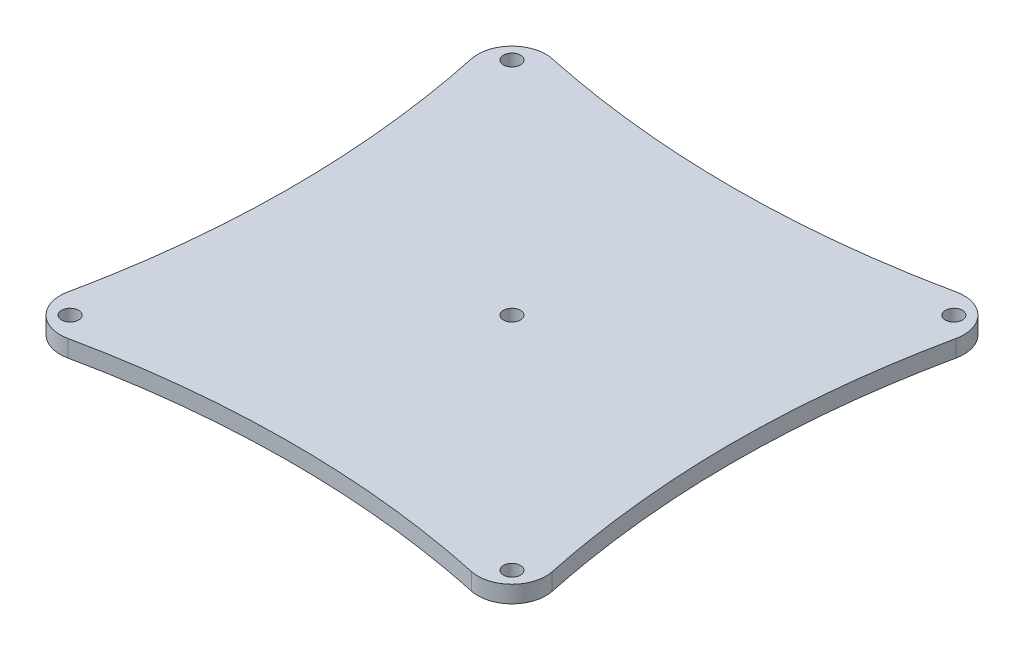
ISO-10303-21;
HEADER;
FILE_DESCRIPTION(('STEP AP214'),'2;1');
FILE_NAME('part.step','',(''),(''),'','','');
FILE_SCHEMA(('AUTOMOTIVE_DESIGN { 1 0 10303 214 1 1 1 1 }'));
ENDSEC;
DATA;
#1=APPLICATION_CONTEXT('core data for automotive mechanical design processes');
#2=APPLICATION_PROTOCOL_DEFINITION('international standard','automotive_design',2000,#1);
#3=PRODUCT_CONTEXT('',#1,'mechanical');
#4=PRODUCT('Part','Part','',(#3));
#5=PRODUCT_RELATED_PRODUCT_CATEGORY('part','',(#4));
#6=PRODUCT_DEFINITION_FORMATION('','',#4);
#7=PRODUCT_DEFINITION_CONTEXT('part definition',#1,'design');
#8=PRODUCT_DEFINITION('design','',#6,#7);
#9=PRODUCT_DEFINITION_SHAPE('','',#8);
#10=(LENGTH_UNIT() NAMED_UNIT(*) SI_UNIT(.MILLI.,.METRE.));
#11=(NAMED_UNIT(*) PLANE_ANGLE_UNIT() SI_UNIT($,.RADIAN.));
#12=(NAMED_UNIT(*) SI_UNIT($,.STERADIAN.) SOLID_ANGLE_UNIT());
#13=UNCERTAINTY_MEASURE_WITH_UNIT(LENGTH_MEASURE(1.E-05),#10,'distance_accuracy_value','');
#14=(GEOMETRIC_REPRESENTATION_CONTEXT(3) GLOBAL_UNCERTAINTY_ASSIGNED_CONTEXT((#13)) GLOBAL_UNIT_ASSIGNED_CONTEXT((#10,
#11,#12)) REPRESENTATION_CONTEXT('',''));
#15=CARTESIAN_POINT('',(0.,0.,0.));
#16=DIRECTION('',(0.,0.,1.));
#17=DIRECTION('',(1.,0.,0.));
#18=AXIS2_PLACEMENT_3D('',#15,#16,#17);
#19=CARTESIAN_POINT('',(173.322472128066,3.175,-173.342498930192));
#20=DIRECTION('',(0.,-1.,0.));
#21=DIRECTION('',(0.,0.,-1.));
#22=AXIS2_PLACEMENT_3D('',#19,#20,#21);
#23=CYLINDRICAL_SURFACE('',#22,12.7);
#24=CARTESIAN_POINT('',(173.322472128065,0.,-173.34249893019));
#25=DIRECTION('',(0.,1.,0.));
#26=DIRECTION('',(0.,0.,1.));
#27=AXIS2_PLACEMENT_3D('',#24,#25,#26);
#28=CIRCLE('',#27,12.7);
#29=CARTESIAN_POINT('',(170.697797431039,0.,-185.768322151804));
#30=VERTEX_POINT('',#29);
#31=CARTESIAN_POINT('',(185.746749635017,0.,-170.710517085599));
#32=VERTEX_POINT('',#31);
#33=EDGE_CURVE('E175',#30,#32,#28,.F.);
#34=ORIENTED_EDGE('',*,*,#33,.F.);
#35=DIRECTION('',(0.,-1.,0.));
#36=VECTOR('',#35,1.);
#37=CARTESIAN_POINT('',(170.697797431039,6.35,-185.768322151804));
#38=LINE('',#37,#36);
#39=CARTESIAN_POINT('',(170.697797431039,6.35,-185.768322151804));
#40=VERTEX_POINT('',#39);
#41=EDGE_CURVE('E115',#40,#30,#38,.T.);
#42=ORIENTED_EDGE('',*,*,#41,.F.);
#43=CARTESIAN_POINT('',(173.322472128065,6.35,-173.34249893019));
#44=DIRECTION('',(0.,1.,0.));
#45=DIRECTION('',(0.,0.,1.));
#46=AXIS2_PLACEMENT_3D('',#43,#44,#45);
#47=CIRCLE('',#46,12.7);
#48=CARTESIAN_POINT('',(185.746749635017,6.35,-170.710517085599));
#49=VERTEX_POINT('',#48);
#50=EDGE_CURVE('E122',#40,#49,#47,.F.);
#51=ORIENTED_EDGE('',*,*,#50,.T.);
#52=DIRECTION('',(0.,-1.,0.));
#53=VECTOR('',#52,1.);
#54=CARTESIAN_POINT('',(185.746749635017,6.35,-170.710517085599));
#55=LINE('',#54,#53);
#56=EDGE_CURVE('E172',#49,#32,#55,.T.);
#57=ORIENTED_EDGE('',*,*,#56,.T.);
#58=EDGE_LOOP('',(#34,#42,#51,#57));
#59=FACE_BOUND('',#58,.T.);
#60=ADVANCED_FACE('F35',(#59),#23,.T.);
#61=CARTESIAN_POINT('',(173.349019247905,3.175,-17.1466710257305));
#62=DIRECTION('',(0.,-1.,0.));
#63=DIRECTION('',(0.,0.,-1.));
#64=AXIS2_PLACEMENT_3D('',#61,#62,#63);
#65=CYLINDRICAL_SURFACE('',#64,12.7);
#66=CARTESIAN_POINT('',(173.349019247892,0.,-17.1466710257332));
#67=DIRECTION('',(0.,1.,0.));
#68=DIRECTION('',(0.,0.,1.));
#69=AXIS2_PLACEMENT_3D('',#66,#67,#68);
#70=CIRCLE('',#69,12.7);
#71=CARTESIAN_POINT('',(185.773513411456,0.,-19.7776299344923));
#72=VERTEX_POINT('',#71);
#73=CARTESIAN_POINT('',(170.697797431039,0.,-4.72648492093428));
#74=VERTEX_POINT('',#73);
#75=EDGE_CURVE('E187',#72,#74,#70,.F.);
#76=ORIENTED_EDGE('',*,*,#75,.F.);
#77=DIRECTION('',(0.,-1.,0.));
#78=VECTOR('',#77,1.);
#79=CARTESIAN_POINT('',(185.773513411456,6.35,-19.7776299344923));
#80=LINE('',#79,#78);
#81=CARTESIAN_POINT('',(185.773513411456,6.35,-19.7776299344923));
#82=VERTEX_POINT('',#81);
#83=EDGE_CURVE('E177',#82,#72,#80,.T.);
#84=ORIENTED_EDGE('',*,*,#83,.F.);
#85=CARTESIAN_POINT('',(173.349019247892,6.35,-17.1466710257332));
#86=DIRECTION('',(0.,1.,0.));
#87=DIRECTION('',(0.,0.,1.));
#88=AXIS2_PLACEMENT_3D('',#85,#86,#87);
#89=CIRCLE('',#88,12.7);
#90=CARTESIAN_POINT('',(170.697797431039,6.35,-4.72648492093428));
#91=VERTEX_POINT('',#90);
#92=EDGE_CURVE('E166',#82,#91,#89,.F.);
#93=ORIENTED_EDGE('',*,*,#92,.T.);
#94=DIRECTION('',(0.,-1.,0.));
#95=VECTOR('',#94,1.);
#96=CARTESIAN_POINT('',(170.697797431039,6.35,-4.72648492093428));
#97=LINE('',#96,#95);
#98=EDGE_CURVE('E43',#91,#74,#97,.T.);
#99=ORIENTED_EDGE('',*,*,#98,.T.);
#100=EDGE_LOOP('',(#76,#84,#93,#99));
#101=FACE_BOUND('',#100,.T.);
#102=ADVANCED_FACE('F185',(#101),#65,.T.);
#103=CARTESIAN_POINT('',(17.1829414635356,3.175,-17.1829163185345));
#104=DIRECTION('',(0.,-1.,0.));
#105=DIRECTION('',(0.,0.,-1.));
#106=AXIS2_PLACEMENT_3D('',#103,#104,#105);
#107=CYLINDRICAL_SURFACE('',#106,12.7);
#108=CARTESIAN_POINT('',(17.182941463536,0.,-17.1829163185367));
#109=DIRECTION('',(0.,1.,0.));
#110=DIRECTION('',(0.,0.,1.));
#111=AXIS2_PLACEMENT_3D('',#108,#109,#110);
#112=CIRCLE('',#111,12.7);
#113=CARTESIAN_POINT('',(4.75848888429607,0.,-19.8140715982983));
#114=VERTEX_POINT('',#113);
#115=CARTESIAN_POINT('',(19.8140882518395,0.,-4.75846194104384));
#116=VERTEX_POINT('',#115);
#117=EDGE_CURVE('E195',#114,#116,#112,.T.);
#118=ORIENTED_EDGE('',*,*,#117,.T.);
#119=DIRECTION('',(0.,-1.,0.));
#120=VECTOR('',#119,1.);
#121=CARTESIAN_POINT('',(19.8140882518395,6.35,-4.75846194104384));
#122=LINE('',#121,#120);
#123=CARTESIAN_POINT('',(19.8140882518395,6.35,-4.75846194104384));
#124=VERTEX_POINT('',#123);
#125=EDGE_CURVE('E11',#124,#116,#122,.T.);
#126=ORIENTED_EDGE('',*,*,#125,.F.);
#127=CARTESIAN_POINT('',(17.182941463536,6.35,-17.1829163185367));
#128=DIRECTION('',(0.,1.,0.));
#129=DIRECTION('',(0.,0.,1.));
#130=AXIS2_PLACEMENT_3D('',#127,#128,#129);
#131=CIRCLE('',#130,12.7);
#132=CARTESIAN_POINT('',(4.75848888429607,6.35,-19.8140715982983));
#133=VERTEX_POINT('',#132);
#134=EDGE_CURVE('E228',#133,#124,#131,.T.);
#135=ORIENTED_EDGE('',*,*,#134,.F.);
#136=DIRECTION('',(0.,-1.,0.));
#137=VECTOR('',#136,1.);
#138=CARTESIAN_POINT('',(4.75848888429607,6.35,-19.8140715982983));
#139=LINE('',#138,#137);
#140=EDGE_CURVE('E126',#133,#114,#139,.T.);
#141=ORIENTED_EDGE('',*,*,#140,.T.);
#142=EDGE_LOOP('',(#118,#126,#135,#141));
#143=FACE_BOUND('',#142,.T.);
#144=ADVANCED_FACE('F227',(#143),#107,.T.);
#145=CARTESIAN_POINT('',(17.1575077953163,3.175,-173.322440287928));
#146=DIRECTION('',(0.,-1.,0.));
#147=DIRECTION('',(0.,0.,-1.));
#148=AXIS2_PLACEMENT_3D('',#145,#146,#147);
#149=CYLINDRICAL_SURFACE('',#148,12.7);
#150=CARTESIAN_POINT('',(17.1575077953184,0.,-173.322440287928));
#151=DIRECTION('',(0.,1.,0.));
#152=DIRECTION('',(0.,0.,1.));
#153=AXIS2_PLACEMENT_3D('',#150,#151,#152);
#154=CIRCLE('',#153,12.7);
#155=CARTESIAN_POINT('',(4.73168435694636,0.,-170.697766617087));
#156=VERTEX_POINT('',#155);
#157=CARTESIAN_POINT('',(19.78949709556,0.,-185.746716215458));
#158=VERTEX_POINT('',#157);
#159=EDGE_CURVE('E213',#156,#158,#154,.F.);
#160=ORIENTED_EDGE('',*,*,#159,.F.);
#161=DIRECTION('',(0.,-1.,0.));
#162=VECTOR('',#161,1.);
#163=CARTESIAN_POINT('',(4.73168435694636,6.35,-170.697766617087));
#164=LINE('',#163,#162);
#165=CARTESIAN_POINT('',(4.73168435694636,6.35,-170.697766617087));
#166=VERTEX_POINT('',#165);
#167=EDGE_CURVE('E79',#166,#156,#164,.T.);
#168=ORIENTED_EDGE('',*,*,#167,.F.);
#169=CARTESIAN_POINT('',(17.1575077953184,6.35,-173.322440287928));
#170=DIRECTION('',(0.,1.,0.));
#171=DIRECTION('',(0.,0.,1.));
#172=AXIS2_PLACEMENT_3D('',#169,#170,#171);
#173=CIRCLE('',#172,12.7);
#174=CARTESIAN_POINT('',(19.78949709556,6.35,-185.746716215458));
#175=VERTEX_POINT('',#174);
#176=EDGE_CURVE('E119',#166,#175,#173,.F.);
#177=ORIENTED_EDGE('',*,*,#176,.T.);
#178=DIRECTION('',(0.,-1.,0.));
#179=VECTOR('',#178,1.);
#180=CARTESIAN_POINT('',(19.78949709556,6.35,-185.746716215458));
#181=LINE('',#180,#179);
#182=EDGE_CURVE('E105',#175,#158,#181,.T.);
#183=ORIENTED_EDGE('',*,*,#182,.T.);
#184=EDGE_LOOP('',(#160,#168,#177,#183));
#185=FACE_BOUND('',#184,.T.);
#186=ADVANCED_FACE('F124',(#185),#149,.T.);
#187=CARTESIAN_POINT('',(19.8140882518395,6.35,-4.75846194104384));
#188=CARTESIAN_POINT('',(44.8371963997863,6.35,-10.057646004705));
#189=CARTESIAN_POINT('',(95.3044221773575,6.35,-15.3264775848769));
#190=CARTESIAN_POINT('',(145.574109724461,6.35,-10.0894052834637));
#191=CARTESIAN_POINT('',(170.697797431039,6.35,-4.72648492093429));
#192=B_SPLINE_CURVE_WITH_KNOTS('',3,(#187,#188,#189,#190,#191),.UNSPECIFIED.,.F.,.F.,(4,1,4),
(0.104614208546919,0.50035773003242,0.896180420296307),.UNSPECIFIED.);
#193=DIRECTION('',(0.,-1.,0.));
#194=VECTOR('',#193,1.);
#195=SURFACE_OF_LINEAR_EXTRUSION('',#192,#194);
#196=CARTESIAN_POINT('',(19.8140882518395,0.,-4.75846194104384));
#197=CARTESIAN_POINT('',(44.8371963997863,0.,-10.057646004705));
#198=CARTESIAN_POINT('',(95.3044221773575,0.,-15.3264775848769));
#199=CARTESIAN_POINT('',(145.574109724461,0.,-10.0894052834637));
#200=CARTESIAN_POINT('',(170.697797431039,0.,-4.72648492093429));
#201=B_SPLINE_CURVE_WITH_KNOTS('',3,(#196,#197,#198,#199,#200),.UNSPECIFIED.,.F.,.F.,(4,1,4),
(0.104614208546919,0.50035773003242,0.896180420296307),.UNSPECIFIED.);
#202=EDGE_CURVE('E190',#116,#74,#201,.T.);
#203=ORIENTED_EDGE('',*,*,#202,.T.);
#204=ORIENTED_EDGE('',*,*,#98,.F.);
#205=EDGE_CURVE('E90',#124,#91,#192,.T.);
#206=ORIENTED_EDGE('',*,*,#205,.F.);
#207=ORIENTED_EDGE('',*,*,#125,.T.);
#208=EDGE_LOOP('',(#203,#204,#206,#207));
#209=FACE_BOUND('',#208,.T.);
#210=ADVANCED_FACE('F156',(#209),#195,.F.);
#211=CARTESIAN_POINT('',(185.746749635017,6.35,-170.710517085599));
#212=CARTESIAN_POINT('',(180.44493801681,6.35,-145.683300819084));
#213=CARTESIAN_POINT('',(175.152166761295,6.35,-95.1916322511341));
#214=CARTESIAN_POINT('',(180.450729476529,6.35,-44.9140536592783));
#215=CARTESIAN_POINT('',(185.773513411456,6.35,-19.7776299344923));
#216=B_SPLINE_CURVE_WITH_KNOTS('',3,(#211,#212,#213,#214,#215),.UNSPECIFIED.,.F.,.F.,(4,1,4),
(0.104484496174819,0.500294391382567,0.896180420296308),.UNSPECIFIED.);
#217=DIRECTION('',(0.,-1.,0.));
#218=VECTOR('',#217,1.);
#219=SURFACE_OF_LINEAR_EXTRUSION('',#216,#218);
#220=CARTESIAN_POINT('',(185.746749635017,0.,-170.710517085599));
#221=CARTESIAN_POINT('',(180.44493801681,0.,-145.683300819084));
#222=CARTESIAN_POINT('',(175.152166761295,0.,-95.1916322511341));
#223=CARTESIAN_POINT('',(180.450729476529,0.,-44.9140536592783));
#224=CARTESIAN_POINT('',(185.773513411456,0.,-19.7776299344923));
#225=B_SPLINE_CURVE_WITH_KNOTS('',3,(#220,#221,#222,#223,#224),.UNSPECIFIED.,.F.,.F.,(4,1,4),
(0.104484496174819,0.500294391382567,0.896180420296308),.UNSPECIFIED.);
#226=EDGE_CURVE('E197',#32,#72,#225,.T.);
#227=ORIENTED_EDGE('',*,*,#226,.F.);
#228=ORIENTED_EDGE('',*,*,#56,.F.);
#229=EDGE_CURVE('E160',#49,#82,#216,.T.);
#230=ORIENTED_EDGE('',*,*,#229,.T.);
#231=ORIENTED_EDGE('',*,*,#83,.T.);
#232=EDGE_LOOP('',(#227,#228,#230,#231));
#233=FACE_BOUND('',#232,.T.);
#234=ADVANCED_FACE('F152',(#233),#219,.T.);
#235=CARTESIAN_POINT('',(19.78949709556,6.35,-185.746716215458));
#236=CARTESIAN_POINT('',(44.8165997125433,6.35,-180.444912980548));
#237=CARTESIAN_POINT('',(95.3011699201255,6.35,-175.147507505945));
#238=CARTESIAN_POINT('',(145.567291034131,6.35,-180.460069886551));
#239=CARTESIAN_POINT('',(170.697797431039,6.35,-185.768322151804));
#240=B_SPLINE_CURVE_WITH_KNOTS('',3,(#235,#236,#237,#238,#239),.UNSPECIFIED.,.F.,.F.,(4,1,4),
(0.104485326636814,0.500295423838561,0.896051430089074),.UNSPECIFIED.);
#241=DIRECTION('',(0.,-1.,0.));
#242=VECTOR('',#241,1.);
#243=SURFACE_OF_LINEAR_EXTRUSION('',#240,#242);
#244=CARTESIAN_POINT('',(19.78949709556,0.,-185.746716215458));
#245=CARTESIAN_POINT('',(44.8165997125433,0.,-180.444912980548));
#246=CARTESIAN_POINT('',(95.3011699201255,0.,-175.147507505945));
#247=CARTESIAN_POINT('',(145.567291034131,0.,-180.460069886551));
#248=CARTESIAN_POINT('',(170.697797431039,0.,-185.768322151804));
#249=B_SPLINE_CURVE_WITH_KNOTS('',3,(#244,#245,#246,#247,#248),.UNSPECIFIED.,.F.,.F.,(4,1,4),
(0.104485326636814,0.500295423838561,0.896051430089074),.UNSPECIFIED.);
#250=EDGE_CURVE('E110',#158,#30,#249,.T.);
#251=ORIENTED_EDGE('',*,*,#250,.F.);
#252=ORIENTED_EDGE('',*,*,#182,.F.);
#253=EDGE_CURVE('E108',#175,#40,#240,.T.);
#254=ORIENTED_EDGE('',*,*,#253,.T.);
#255=ORIENTED_EDGE('',*,*,#41,.T.);
#256=EDGE_LOOP('',(#251,#252,#254,#255));
#257=FACE_BOUND('',#256,.T.);
#258=ADVANCED_FACE('F107',(#257),#243,.T.);
#259=CARTESIAN_POINT('',(95.25,6.35,-95.25));
#260=DIRECTION('',(0.,-1.,0.));
#261=DIRECTION('',(0.,0.,-1.));
#262=AXIS2_PLACEMENT_3D('',#259,#260,#261);
#263=CYLINDRICAL_SURFACE('',#262,3.175);
#264=CARTESIAN_POINT('',(95.25,6.35,-95.25));
#265=DIRECTION('',(0.,1.,0.));
#266=DIRECTION('',(0.,0.,1.));
#267=AXIS2_PLACEMENT_3D('',#264,#265,#266);
#268=CIRCLE('',#267,3.175);
#269=CARTESIAN_POINT('',(95.25,6.35,-92.075));
#270=VERTEX_POINT('',#269);
#271=EDGE_CURVE('E368',#270,#270,#268,.T.);
#272=ORIENTED_EDGE('',*,*,#271,.T.);
#273=EDGE_LOOP('',(#272));
#274=FACE_BOUND('',#273,.T.);
#275=CARTESIAN_POINT('',(95.25,0.,-95.25));
#276=DIRECTION('',(0.,1.,0.));
#277=DIRECTION('',(0.,0.,1.));
#278=AXIS2_PLACEMENT_3D('',#275,#276,#277);
#279=CIRCLE('',#278,3.175);
#280=CARTESIAN_POINT('',(95.25,0.,-92.075));
#281=VERTEX_POINT('',#280);
#282=EDGE_CURVE('E229',#281,#281,#279,.T.);
#283=ORIENTED_EDGE('',*,*,#282,.F.);
#284=EDGE_LOOP('',(#283));
#285=FACE_BOUND('',#284,.T.);
#286=ADVANCED_FACE('F151',(#274,#285),#263,.F.);
#287=CARTESIAN_POINT('',(177.8,6.35,-177.8));
#288=DIRECTION('',(0.,-1.,0.));
#289=DIRECTION('',(0.,0.,-1.));
#290=AXIS2_PLACEMENT_3D('',#287,#288,#289);
#291=CYLINDRICAL_SURFACE('',#290,3.175);
#292=CARTESIAN_POINT('',(177.8,6.35,-177.8));
#293=DIRECTION('',(0.,1.,0.));
#294=DIRECTION('',(0.,0.,1.));
#295=AXIS2_PLACEMENT_3D('',#292,#293,#294);
#296=CIRCLE('',#295,3.175);
#297=CARTESIAN_POINT('',(177.8,6.35,-174.625));
#298=VERTEX_POINT('',#297);
#299=EDGE_CURVE('E365',#298,#298,#296,.T.);
#300=ORIENTED_EDGE('',*,*,#299,.T.);
#301=EDGE_LOOP('',(#300));
#302=FACE_BOUND('',#301,.T.);
#303=CARTESIAN_POINT('',(177.8,0.,-177.8));
#304=DIRECTION('',(0.,1.,0.));
#305=DIRECTION('',(0.,0.,1.));
#306=AXIS2_PLACEMENT_3D('',#303,#304,#305);
#307=CIRCLE('',#306,3.175);
#308=CARTESIAN_POINT('',(177.8,0.,-174.625));
#309=VERTEX_POINT('',#308);
#310=EDGE_CURVE('E231',#309,#309,#307,.T.);
#311=ORIENTED_EDGE('',*,*,#310,.F.);
#312=EDGE_LOOP('',(#311));
#313=FACE_BOUND('',#312,.T.);
#314=ADVANCED_FACE('F286',(#302,#313),#291,.F.);
#315=CARTESIAN_POINT('',(177.8,6.35,-12.7));
#316=DIRECTION('',(0.,-1.,0.));
#317=DIRECTION('',(0.,0.,-1.));
#318=AXIS2_PLACEMENT_3D('',#315,#316,#317);
#319=CYLINDRICAL_SURFACE('',#318,3.175);
#320=CARTESIAN_POINT('',(177.8,6.35,-12.7));
#321=DIRECTION('',(0.,1.,0.));
#322=DIRECTION('',(0.,0.,1.));
#323=AXIS2_PLACEMENT_3D('',#320,#321,#322);
#324=CIRCLE('',#323,3.175);
#325=CARTESIAN_POINT('',(177.8,6.35,-9.52499999999999));
#326=VERTEX_POINT('',#325);
#327=EDGE_CURVE('E361',#326,#326,#324,.T.);
#328=ORIENTED_EDGE('',*,*,#327,.T.);
#329=EDGE_LOOP('',(#328));
#330=FACE_BOUND('',#329,.T.);
#331=CARTESIAN_POINT('',(177.8,0.,-12.7));
#332=DIRECTION('',(0.,1.,0.));
#333=DIRECTION('',(0.,0.,1.));
#334=AXIS2_PLACEMENT_3D('',#331,#332,#333);
#335=CIRCLE('',#334,3.175);
#336=CARTESIAN_POINT('',(177.8,0.,-9.52499999999999));
#337=VERTEX_POINT('',#336);
#338=EDGE_CURVE('E236',#337,#337,#335,.T.);
#339=ORIENTED_EDGE('',*,*,#338,.F.);
#340=EDGE_LOOP('',(#339));
#341=FACE_BOUND('',#340,.T.);
#342=ADVANCED_FACE('F253',(#330,#341),#319,.F.);
#343=CARTESIAN_POINT('',(12.7,6.35,-12.7));
#344=DIRECTION('',(0.,-1.,0.));
#345=DIRECTION('',(0.,0.,-1.));
#346=AXIS2_PLACEMENT_3D('',#343,#344,#345);
#347=CYLINDRICAL_SURFACE('',#346,3.175);
#348=CARTESIAN_POINT('',(12.7,6.35,-12.7));
#349=DIRECTION('',(0.,1.,0.));
#350=DIRECTION('',(0.,0.,1.));
#351=AXIS2_PLACEMENT_3D('',#348,#349,#350);
#352=CIRCLE('',#351,3.175);
#353=CARTESIAN_POINT('',(12.7,6.35,-9.52499999999999));
#354=VERTEX_POINT('',#353);
#355=EDGE_CURVE('E357',#354,#354,#352,.T.);
#356=ORIENTED_EDGE('',*,*,#355,.T.);
#357=EDGE_LOOP('',(#356));
#358=FACE_BOUND('',#357,.T.);
#359=CARTESIAN_POINT('',(12.7,0.,-12.7));
#360=DIRECTION('',(0.,1.,0.));
#361=DIRECTION('',(0.,0.,1.));
#362=AXIS2_PLACEMENT_3D('',#359,#360,#361);
#363=CIRCLE('',#362,3.175);
#364=CARTESIAN_POINT('',(12.7,0.,-9.52499999999999));
#365=VERTEX_POINT('',#364);
#366=EDGE_CURVE('E238',#365,#365,#363,.T.);
#367=ORIENTED_EDGE('',*,*,#366,.F.);
#368=EDGE_LOOP('',(#367));
#369=FACE_BOUND('',#368,.T.);
#370=ADVANCED_FACE('F247',(#358,#369),#347,.F.);
#371=CARTESIAN_POINT('',(12.7,6.35,-177.8));
#372=DIRECTION('',(0.,-1.,0.));
#373=DIRECTION('',(0.,0.,-1.));
#374=AXIS2_PLACEMENT_3D('',#371,#372,#373);
#375=CYLINDRICAL_SURFACE('',#374,3.175);
#376=CARTESIAN_POINT('',(12.7,6.35,-177.8));
#377=DIRECTION('',(0.,1.,0.));
#378=DIRECTION('',(0.,0.,1.));
#379=AXIS2_PLACEMENT_3D('',#376,#377,#378);
#380=CIRCLE('',#379,3.175);
#381=CARTESIAN_POINT('',(12.7,6.35,-174.625));
#382=VERTEX_POINT('',#381);
#383=EDGE_CURVE('E221',#382,#382,#380,.T.);
#384=ORIENTED_EDGE('',*,*,#383,.T.);
#385=EDGE_LOOP('',(#384));
#386=FACE_BOUND('',#385,.T.);
#387=CARTESIAN_POINT('',(12.7,0.,-177.8));
#388=DIRECTION('',(0.,1.,0.));
#389=DIRECTION('',(0.,0.,1.));
#390=AXIS2_PLACEMENT_3D('',#387,#388,#389);
#391=CIRCLE('',#390,3.175);
#392=CARTESIAN_POINT('',(12.7,0.,-174.625));
#393=VERTEX_POINT('',#392);
#394=EDGE_CURVE('E136',#393,#393,#391,.T.);
#395=ORIENTED_EDGE('',*,*,#394,.F.);
#396=EDGE_LOOP('',(#395));
#397=FACE_BOUND('',#396,.T.);
#398=ADVANCED_FACE('F146',(#386,#397),#375,.F.);
#399=CARTESIAN_POINT('',(4.73168435694635,6.35,-170.697766617087));
#400=CARTESIAN_POINT('',(10.0399374905727,6.35,-145.567245845276));
#401=CARTESIAN_POINT('',(15.3516219067974,6.35,-95.3095365760446));
#402=CARTESIAN_POINT('',(10.0568155491037,6.35,-44.8330466859773));
#403=CARTESIAN_POINT('',(4.75848888429606,6.35,-19.8140715982982));
#404=B_SPLINE_CURVE_WITH_KNOTS('',3,(#399,#400,#401,#402,#403),.UNSPECIFIED.,.F.,.F.,(4,1,4),
(0.103948731668706,0.499704964295737,0.895385121940053),.UNSPECIFIED.);
#405=DIRECTION('',(0.,-1.,0.));
#406=VECTOR('',#405,1.);
#407=SURFACE_OF_LINEAR_EXTRUSION('',#404,#406);
#408=CARTESIAN_POINT('',(4.73168435694635,0.,-170.697766617087));
#409=CARTESIAN_POINT('',(10.0399374905727,0.,-145.567245845276));
#410=CARTESIAN_POINT('',(15.3516219067974,0.,-95.3095365760446));
#411=CARTESIAN_POINT('',(10.0568155491037,0.,-44.8330466859773));
#412=CARTESIAN_POINT('',(4.75848888429606,0.,-19.8140715982982));
#413=B_SPLINE_CURVE_WITH_KNOTS('',3,(#408,#409,#410,#411,#412),.UNSPECIFIED.,.F.,.F.,(4,1,4),
(0.103948731668706,0.499704964295737,0.895385121940053),.UNSPECIFIED.);
#414=EDGE_CURVE('E82',#156,#114,#413,.T.);
#415=ORIENTED_EDGE('',*,*,#414,.T.);
#416=ORIENTED_EDGE('',*,*,#140,.F.);
#417=EDGE_CURVE('E51',#166,#133,#404,.T.);
#418=ORIENTED_EDGE('',*,*,#417,.F.);
#419=ORIENTED_EDGE('',*,*,#167,.T.);
#420=EDGE_LOOP('',(#415,#416,#418,#419));
#421=FACE_BOUND('',#420,.T.);
#422=ADVANCED_FACE('F142',(#421),#407,.F.);
#423=CARTESIAN_POINT('',(0.,6.35,0.));
#424=DIRECTION('',(0.,1.,0.));
#425=DIRECTION('',(0.,0.,1.));
#426=AXIS2_PLACEMENT_3D('',#423,#424,#425);
#427=PLANE('',#426);
#428=ORIENTED_EDGE('',*,*,#383,.F.);
#429=EDGE_LOOP('',(#428));
#430=FACE_BOUND('',#429,.T.);
#431=ORIENTED_EDGE('',*,*,#355,.F.);
#432=EDGE_LOOP('',(#431));
#433=FACE_BOUND('',#432,.T.);
#434=ORIENTED_EDGE('',*,*,#327,.F.);
#435=EDGE_LOOP('',(#434));
#436=FACE_BOUND('',#435,.T.);
#437=ORIENTED_EDGE('',*,*,#299,.F.);
#438=EDGE_LOOP('',(#437));
#439=FACE_BOUND('',#438,.T.);
#440=ORIENTED_EDGE('',*,*,#271,.F.);
#441=EDGE_LOOP('',(#440));
#442=FACE_BOUND('',#441,.T.);
#443=ORIENTED_EDGE('',*,*,#134,.T.);
#444=ORIENTED_EDGE('',*,*,#205,.T.);
#445=ORIENTED_EDGE('',*,*,#92,.F.);
#446=ORIENTED_EDGE('',*,*,#229,.F.);
#447=ORIENTED_EDGE('',*,*,#50,.F.);
#448=ORIENTED_EDGE('',*,*,#253,.F.);
#449=ORIENTED_EDGE('',*,*,#176,.F.);
#450=ORIENTED_EDGE('',*,*,#417,.T.);
#451=EDGE_LOOP('',(#443,#444,#445,#446,#447,#448,#449,#450));
#452=FACE_BOUND('',#451,.T.);
#453=ADVANCED_FACE('F118',(#430,#433,#436,#439,#442,#452),#427,.T.);
#454=CARTESIAN_POINT('',(0.,0.,0.));
#455=DIRECTION('',(0.,1.,0.));
#456=DIRECTION('',(0.,0.,1.));
#457=AXIS2_PLACEMENT_3D('',#454,#455,#456);
#458=PLANE('',#457);
#459=ORIENTED_EDGE('',*,*,#394,.T.);
#460=EDGE_LOOP('',(#459));
#461=FACE_BOUND('',#460,.T.);
#462=ORIENTED_EDGE('',*,*,#366,.T.);
#463=EDGE_LOOP('',(#462));
#464=FACE_BOUND('',#463,.T.);
#465=ORIENTED_EDGE('',*,*,#338,.T.);
#466=EDGE_LOOP('',(#465));
#467=FACE_BOUND('',#466,.T.);
#468=ORIENTED_EDGE('',*,*,#310,.T.);
#469=EDGE_LOOP('',(#468));
#470=FACE_BOUND('',#469,.T.);
#471=ORIENTED_EDGE('',*,*,#282,.T.);
#472=EDGE_LOOP('',(#471));
#473=FACE_BOUND('',#472,.T.);
#474=ORIENTED_EDGE('',*,*,#117,.F.);
#475=ORIENTED_EDGE('',*,*,#414,.F.);
#476=ORIENTED_EDGE('',*,*,#159,.T.);
#477=ORIENTED_EDGE('',*,*,#250,.T.);
#478=ORIENTED_EDGE('',*,*,#33,.T.);
#479=ORIENTED_EDGE('',*,*,#226,.T.);
#480=ORIENTED_EDGE('',*,*,#75,.T.);
#481=ORIENTED_EDGE('',*,*,#202,.F.);
#482=EDGE_LOOP('',(#474,#475,#476,#477,#478,#479,#480,#481));
#483=FACE_BOUND('',#482,.T.);
#484=ADVANCED_FACE('F147',(#461,#464,#467,#470,#473,#483),#458,.F.);
#485=CLOSED_SHELL('',(#60,#102,#144,#186,#210,#234,#258,#286,#314,#342,#370,#398,#422,#453,#484));
#486=MANIFOLD_SOLID_BREP('B2',#485);
#487=ADVANCED_BREP_SHAPE_REPRESENTATION('',(#18,#486),#14);
#488=SHAPE_DEFINITION_REPRESENTATION(#9,#487);
ENDSEC;
END-ISO-10303-21;
